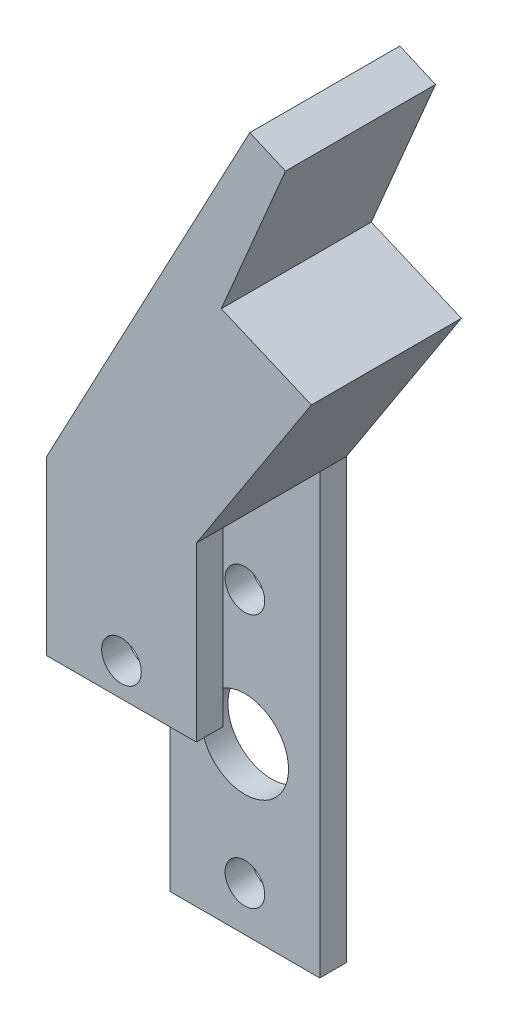
ISO-10303-21;
HEADER;
FILE_DESCRIPTION(('STEP AP214'),'2;1');
FILE_NAME('part.step','',(''),(''),'','','');
FILE_SCHEMA(('AUTOMOTIVE_DESIGN { 1 0 10303 214 1 1 1 1 }'));
ENDSEC;
DATA;
#1=APPLICATION_CONTEXT('core data for automotive mechanical design processes');
#2=APPLICATION_PROTOCOL_DEFINITION('international standard','automotive_design',2000,#1);
#3=PRODUCT_CONTEXT('',#1,'mechanical');
#4=PRODUCT('Part','Part','',(#3));
#5=PRODUCT_RELATED_PRODUCT_CATEGORY('part','',(#4));
#6=PRODUCT_DEFINITION_FORMATION('','',#4);
#7=PRODUCT_DEFINITION_CONTEXT('part definition',#1,'design');
#8=PRODUCT_DEFINITION('design','',#6,#7);
#9=PRODUCT_DEFINITION_SHAPE('','',#8);
#10=(LENGTH_UNIT() NAMED_UNIT(*) SI_UNIT(.MILLI.,.METRE.));
#11=(NAMED_UNIT(*) PLANE_ANGLE_UNIT() SI_UNIT($,.RADIAN.));
#12=(NAMED_UNIT(*) SI_UNIT($,.STERADIAN.) SOLID_ANGLE_UNIT());
#13=UNCERTAINTY_MEASURE_WITH_UNIT(LENGTH_MEASURE(1.E-05),#10,'distance_accuracy_value','');
#14=(GEOMETRIC_REPRESENTATION_CONTEXT(3) GLOBAL_UNCERTAINTY_ASSIGNED_CONTEXT((#13)) GLOBAL_UNIT_ASSIGNED_CONTEXT((#10,
#11,#12)) REPRESENTATION_CONTEXT('',''));
#15=CARTESIAN_POINT('',(0.,0.,0.));
#16=DIRECTION('',(0.,0.,1.));
#17=DIRECTION('',(1.,0.,0.));
#18=AXIS2_PLACEMENT_3D('',#15,#16,#17);
#19=CARTESIAN_POINT('',(-110.514643089675,1.26241017740988,14.3256));
#20=DIRECTION('',(1.,0.,0.));
#21=DIRECTION('',(0.,0.,-1.));
#22=AXIS2_PLACEMENT_3D('',#19,#20,#21);
#23=PLANE('',#22);
#24=DIRECTION('',(0.,0.,-1.));
#25=VECTOR('',#24,1.);
#26=CARTESIAN_POINT('',(-110.514643089675,26.6624101774099,14.3256));
#27=LINE('',#26,#25);
#28=CARTESIAN_POINT('',(-110.514643089675,26.6624101774099,14.3256));
#29=VERTEX_POINT('',#28);
#30=CARTESIAN_POINT('',(-110.514643089675,26.6624101774099,11.7856));
#31=VERTEX_POINT('',#30);
#32=EDGE_CURVE('E48',#29,#31,#27,.T.);
#33=ORIENTED_EDGE('',*,*,#32,.F.);
#34=DIRECTION('',(0.,-1.,0.));
#35=VECTOR('',#34,1.);
#36=CARTESIAN_POINT('',(-110.514643089675,1.26241017740988,14.3256));
#37=LINE('',#36,#35);
#38=CARTESIAN_POINT('',(-110.514643089675,43.1216101774099,14.3256));
#39=VERTEX_POINT('',#38);
#40=EDGE_CURVE('E134',#39,#29,#37,.T.);
#41=ORIENTED_EDGE('',*,*,#40,.F.);
#42=DIRECTION('',(0.,0.,-1.));
#43=VECTOR('',#42,1.);
#44=CARTESIAN_POINT('',(-110.514643089675,43.1216101774099,14.3256));
#45=LINE('',#44,#43);
#46=CARTESIAN_POINT('',(-110.514643089675,43.1216101774099,11.7856));
#47=VERTEX_POINT('',#46);
#48=EDGE_CURVE('E176',#39,#47,#45,.T.);
#49=ORIENTED_EDGE('',*,*,#48,.T.);
#50=DIRECTION('',(0.,1.,0.));
#51=VECTOR('',#50,1.);
#52=CARTESIAN_POINT('',(-110.514643089675,1.26241017740988,11.7856));
#53=LINE('',#52,#51);
#54=EDGE_CURVE('E54',#31,#47,#53,.T.);
#55=ORIENTED_EDGE('',*,*,#54,.F.);
#56=EDGE_LOOP('',(#33,#41,#49,#55));
#57=FACE_BOUND('',#56,.T.);
#58=ADVANCED_FACE('F33',(#57),#23,.F.);
#59=CARTESIAN_POINT('',(-96.2144430896747,1.26241017740988,14.3256));
#60=DIRECTION('',(-1.,0.,0.));
#61=DIRECTION('',(0.,-1.,0.));
#62=AXIS2_PLACEMENT_3D('',#59,#60,#61);
#63=PLANE('',#62);
#64=DIRECTION('',(0.,0.,-1.));
#65=VECTOR('',#64,1.);
#66=CARTESIAN_POINT('',(-96.2144430896746,26.6624101774099,0.));
#67=LINE('',#66,#65);
#68=CARTESIAN_POINT('',(-96.2144430896746,26.6624101774099,14.3256));
#69=VERTEX_POINT('',#68);
#70=CARTESIAN_POINT('',(-96.2144430896746,26.6624101774099,11.7856));
#71=VERTEX_POINT('',#70);
#72=EDGE_CURVE('E120',#69,#71,#67,.T.);
#73=ORIENTED_EDGE('',*,*,#72,.T.);
#74=DIRECTION('',(0.,1.,0.));
#75=VECTOR('',#74,1.);
#76=CARTESIAN_POINT('',(-96.2144430896747,0.,11.7856));
#77=LINE('',#76,#75);
#78=CARTESIAN_POINT('',(-96.2144430896746,43.1216101774099,11.7856));
#79=VERTEX_POINT('',#78);
#80=EDGE_CURVE('E273',#71,#79,#77,.T.);
#81=ORIENTED_EDGE('',*,*,#80,.T.);
#82=DIRECTION('',(0.,0.,-1.));
#83=VECTOR('',#82,1.);
#84=CARTESIAN_POINT('',(-96.2144430896746,43.1216101774099,14.3256));
#85=LINE('',#84,#83);
#86=CARTESIAN_POINT('',(-96.2144430896746,43.1216101774099,14.3256));
#87=VERTEX_POINT('',#86);
#88=EDGE_CURVE('E138',#87,#79,#85,.T.);
#89=ORIENTED_EDGE('',*,*,#88,.F.);
#90=DIRECTION('',(0.,1.,0.));
#91=VECTOR('',#90,1.);
#92=CARTESIAN_POINT('',(-96.2144430896747,1.26241017740988,14.3256));
#93=LINE('',#92,#91);
#94=EDGE_CURVE('E131',#69,#87,#93,.T.);
#95=ORIENTED_EDGE('',*,*,#94,.F.);
#96=EDGE_LOOP('',(#73,#81,#89,#95));
#97=FACE_BOUND('',#96,.T.);
#98=ADVANCED_FACE('F136',(#97),#63,.F.);
#99=CARTESIAN_POINT('',(0.,0.,14.3256));
#100=DIRECTION('',(0.,0.,-1.));
#101=DIRECTION('',(-1.,0.,0.));
#102=AXIS2_PLACEMENT_3D('',#99,#100,#101);
#103=PLANE('',#102);
#104=CARTESIAN_POINT('',(-103.364543089675,29.8120101774099,14.3256));
#105=DIRECTION('',(0.,0.,1.));
#106=DIRECTION('',(1.,0.,0.));
#107=AXIS2_PLACEMENT_3D('',#104,#105,#106);
#108=CIRCLE('',#107,1.89230000000001);
#109=CARTESIAN_POINT('',(-101.472243089675,29.8120101774099,14.3256));
#110=VERTEX_POINT('',#109);
#111=EDGE_CURVE('E217',#110,#110,#108,.T.);
#112=ORIENTED_EDGE('',*,*,#111,.F.);
#113=EDGE_LOOP('',(#112));
#114=FACE_BOUND('',#113,.T.);
#115=DIRECTION('',(1.,0.,0.));
#116=VECTOR('',#115,1.);
#117=CARTESIAN_POINT('',(-110.540043089675,26.6624101774099,14.3256));
#118=LINE('',#117,#116);
#119=EDGE_CURVE('E123',#29,#69,#118,.T.);
#120=ORIENTED_EDGE('',*,*,#119,.T.);
#121=ORIENTED_EDGE('',*,*,#94,.T.);
#122=DIRECTION('',(0.544639035015021,0.838670567945428,0.));
#123=VECTOR('',#122,1.);
#124=CARTESIAN_POINT('',(-96.2144430896746,43.1216101774099,14.3256));
#125=LINE('',#124,#123);
#126=CARTESIAN_POINT('',(-85.2303808871057,60.0355827235061,14.3256));
#127=VERTEX_POINT('',#126);
#128=EDGE_CURVE('E140',#87,#127,#125,.T.);
#129=ORIENTED_EDGE('',*,*,#128,.T.);
#130=DIRECTION('',(-0.920504853452446,0.390731128489259,0.));
#131=VECTOR('',#130,1.);
#132=CARTESIAN_POINT('',(-85.2303808871057,60.0355827235061,14.3256));
#133=LINE('',#132,#131);
#134=CARTESIAN_POINT('',(-93.8345238532964,63.6878247277209,14.3256));
#135=VERTEX_POINT('',#134);
#136=EDGE_CURVE('E142',#127,#135,#133,.T.);
#137=ORIENTED_EDGE('',*,*,#136,.T.);
#138=DIRECTION('',(0.39073112848926,0.920504853452446,0.));
#139=VECTOR('',#138,1.);
#140=CARTESIAN_POINT('',(-93.8345238532964,63.6878247277209,14.3256));
#141=LINE('',#140,#139);
#142=CARTESIAN_POINT('',(-87.7011391831749,78.1371735133344,14.3256));
#143=VERTEX_POINT('',#142);
#144=EDGE_CURVE('E149',#135,#143,#141,.T.);
#145=ORIENTED_EDGE('',*,*,#144,.T.);
#146=DIRECTION('',(-0.918111761638845,0.396321577939452,0.));
#147=VECTOR('',#146,1.);
#148=CARTESIAN_POINT('',(-91.1133551802976,79.6101258103794,14.3256));
#149=LINE('',#148,#147);
#150=CARTESIAN_POINT('',(-91.1133551802976,79.6101258103794,14.3256));
#151=VERTEX_POINT('',#150);
#152=EDGE_CURVE('E151',#143,#151,#149,.T.);
#153=ORIENTED_EDGE('',*,*,#152,.T.);
#154=DIRECTION('',(-0.469471562785889,-0.882947592858928,0.));
#155=VECTOR('',#154,1.);
#156=CARTESIAN_POINT('',(-110.514643089675,43.1216101774099,14.3256));
#157=LINE('',#156,#155);
#158=EDGE_CURVE('E153',#151,#39,#157,.T.);
#159=ORIENTED_EDGE('',*,*,#158,.T.);
#160=ORIENTED_EDGE('',*,*,#40,.T.);
#161=EDGE_LOOP('',(#120,#121,#129,#137,#145,#153,#159,#160));
#162=FACE_BOUND('',#161,.T.);
#163=ADVANCED_FACE('F130',(#114,#162),#103,.F.);
#164=CARTESIAN_POINT('',(-110.540043089675,0.,11.7856));
#165=DIRECTION('',(0.,0.,-1.));
#166=DIRECTION('',(-1.,0.,0.));
#167=AXIS2_PLACEMENT_3D('',#164,#165,#166);
#168=PLANE('',#167);
#169=CARTESIAN_POINT('',(-103.364543089675,29.8120101774099,11.7856));
#170=DIRECTION('',(0.,0.,-1.));
#171=DIRECTION('',(-1.,0.,0.));
#172=AXIS2_PLACEMENT_3D('',#169,#170,#171);
#173=CIRCLE('',#172,1.89230000000001);
#174=CARTESIAN_POINT('',(-105.256843089675,29.8120101774099,11.7856));
#175=VERTEX_POINT('',#174);
#176=EDGE_CURVE('E197',#175,#175,#173,.F.);
#177=ORIENTED_EDGE('',*,*,#176,.T.);
#178=EDGE_LOOP('',(#177));
#179=FACE_BOUND('',#178,.T.);
#180=ORIENTED_EDGE('',*,*,#80,.F.);
#181=DIRECTION('',(-1.,0.,0.));
#182=VECTOR('',#181,1.);
#183=CARTESIAN_POINT('',(-110.540043089675,26.6624101774099,11.7856));
#184=LINE('',#183,#182);
#185=EDGE_CURVE('E11',#71,#31,#184,.T.);
#186=ORIENTED_EDGE('',*,*,#185,.T.);
#187=ORIENTED_EDGE('',*,*,#54,.T.);
#188=DIRECTION('',(1.,0.,0.));
#189=VECTOR('',#188,1.);
#190=CARTESIAN_POINT('',(-110.540043089675,43.1216101774099,11.7856));
#191=LINE('',#190,#189);
#192=EDGE_CURVE('E258',#47,#79,#191,.T.);
#193=ORIENTED_EDGE('',*,*,#192,.T.);
#194=EDGE_LOOP('',(#180,#186,#187,#193));
#195=FACE_BOUND('',#194,.T.);
#196=ADVANCED_FACE('F290',(#179,#195),#168,.T.);
#197=DIRECTION('',(0.,-1.,0.));
#198=VECTOR('',#197,1.);
#199=CARTESIAN_POINT('',(-110.514643089675,1.26241017740989,2.54));
#200=LINE('',#199,#198);
#201=CARTESIAN_POINT('',(-110.514643089675,43.1216101774099,2.54));
#202=VERTEX_POINT('',#201);
#203=CARTESIAN_POINT('',(-110.514643089675,1.26241017740989,2.54));
#204=VERTEX_POINT('',#203);
#205=EDGE_CURVE('E215',#202,#204,#200,.T.);
#206=ORIENTED_EDGE('',*,*,#205,.F.);
#207=CARTESIAN_POINT('',(-110.514643089675,43.1216101774099,0.));
#208=VERTEX_POINT('',#207);
#209=EDGE_CURVE('E155',#202,#208,#45,.T.);
#210=ORIENTED_EDGE('',*,*,#209,.T.);
#211=DIRECTION('',(0.,-1.,0.));
#212=VECTOR('',#211,1.);
#213=CARTESIAN_POINT('',(-110.514643089675,1.26241017740988,0.));
#214=LINE('',#213,#212);
#215=CARTESIAN_POINT('',(-110.514643089675,1.26241017740988,0.));
#216=VERTEX_POINT('',#215);
#217=EDGE_CURVE('E156',#208,#216,#214,.T.);
#218=ORIENTED_EDGE('',*,*,#217,.T.);
#219=DIRECTION('',(0.,0.,-1.));
#220=VECTOR('',#219,1.);
#221=CARTESIAN_POINT('',(-110.514643089675,1.26241017740988,14.3256));
#222=LINE('',#221,#220);
#223=EDGE_CURVE('E41',#204,#216,#222,.T.);
#224=ORIENTED_EDGE('',*,*,#223,.F.);
#225=EDGE_LOOP('',(#206,#210,#218,#224));
#226=FACE_BOUND('',#225,.T.);
#227=ADVANCED_FACE('F35',(#226),#23,.F.);
#228=CARTESIAN_POINT('',(-110.514643089675,1.26241017740988,14.3256));
#229=DIRECTION('',(0.,1.,0.));
#230=DIRECTION('',(0.,0.,1.));
#231=AXIS2_PLACEMENT_3D('',#228,#229,#230);
#232=PLANE('',#231);
#233=DIRECTION('',(1.,0.,0.));
#234=VECTOR('',#233,1.);
#235=CARTESIAN_POINT('',(-110.540043089675,1.26241017740989,2.54));
#236=LINE('',#235,#234);
#237=CARTESIAN_POINT('',(-96.2144430896747,1.26241017740988,2.54));
#238=VERTEX_POINT('',#237);
#239=EDGE_CURVE('E199',#204,#238,#236,.T.);
#240=ORIENTED_EDGE('',*,*,#239,.F.);
#241=ORIENTED_EDGE('',*,*,#223,.T.);
#242=DIRECTION('',(1.,0.,0.));
#243=VECTOR('',#242,1.);
#244=CARTESIAN_POINT('',(-110.514643089675,1.26241017740988,0.));
#245=LINE('',#244,#243);
#246=CARTESIAN_POINT('',(-96.2144430896747,1.26241017740988,0.));
#247=VERTEX_POINT('',#246);
#248=EDGE_CURVE('E159',#216,#247,#245,.T.);
#249=ORIENTED_EDGE('',*,*,#248,.T.);
#250=DIRECTION('',(0.,0.,-1.));
#251=VECTOR('',#250,1.);
#252=CARTESIAN_POINT('',(-96.2144430896747,1.26241017740988,14.3256));
#253=LINE('',#252,#251);
#254=EDGE_CURVE('E194',#238,#247,#253,.T.);
#255=ORIENTED_EDGE('',*,*,#254,.F.);
#256=EDGE_LOOP('',(#240,#241,#249,#255));
#257=FACE_BOUND('',#256,.T.);
#258=ADVANCED_FACE('F256',(#257),#232,.F.);
#259=DIRECTION('',(0.,-1.,0.));
#260=VECTOR('',#259,1.);
#261=CARTESIAN_POINT('',(-96.2144430896747,0.,2.54));
#262=LINE('',#261,#260);
#263=CARTESIAN_POINT('',(-96.2144430896746,43.1216101774099,2.54));
#264=VERTEX_POINT('',#263);
#265=EDGE_CURVE('E269',#264,#238,#262,.T.);
#266=ORIENTED_EDGE('',*,*,#265,.T.);
#267=ORIENTED_EDGE('',*,*,#254,.T.);
#268=DIRECTION('',(0.,1.,0.));
#269=VECTOR('',#268,1.);
#270=CARTESIAN_POINT('',(-96.2144430896747,1.26241017740988,0.));
#271=LINE('',#270,#269);
#272=CARTESIAN_POINT('',(-96.2144430896746,43.1216101774099,0.));
#273=VERTEX_POINT('',#272);
#274=EDGE_CURVE('E163',#247,#273,#271,.T.);
#275=ORIENTED_EDGE('',*,*,#274,.T.);
#276=EDGE_CURVE('E192',#264,#273,#85,.T.);
#277=ORIENTED_EDGE('',*,*,#276,.F.);
#278=EDGE_LOOP('',(#266,#267,#275,#277));
#279=FACE_BOUND('',#278,.T.);
#280=ADVANCED_FACE('F235',(#279),#63,.F.);
#281=CARTESIAN_POINT('',(-103.364543089675,5.52961017740988,0.));
#282=DIRECTION('',(0.,0.,1.));
#283=DIRECTION('',(1.,0.,0.));
#284=AXIS2_PLACEMENT_3D('',#281,#282,#283);
#285=CYLINDRICAL_SURFACE('',#284,1.89230000000001);
#286=CARTESIAN_POINT('',(-103.364543089675,5.52961017740988,0.));
#287=DIRECTION('',(0.,0.,1.));
#288=DIRECTION('',(1.,0.,0.));
#289=AXIS2_PLACEMENT_3D('',#286,#287,#288);
#290=CIRCLE('',#289,1.89230000000001);
#291=CARTESIAN_POINT('',(-101.472243089675,5.52961017740988,0.));
#292=VERTEX_POINT('',#291);
#293=EDGE_CURVE('E160',#292,#292,#290,.T.);
#294=ORIENTED_EDGE('',*,*,#293,.F.);
#295=EDGE_LOOP('',(#294));
#296=FACE_BOUND('',#295,.T.);
#297=CARTESIAN_POINT('',(-103.364543089675,5.52961017740988,2.54));
#298=DIRECTION('',(0.,0.,1.));
#299=DIRECTION('',(0.,-1.,0.));
#300=AXIS2_PLACEMENT_3D('',#297,#298,#299);
#301=CIRCLE('',#300,1.89230000000001);
#302=CARTESIAN_POINT('',(-103.364543089675,3.63731017740988,2.54));
#303=VERTEX_POINT('',#302);
#304=EDGE_CURVE('E206',#303,#303,#301,.F.);
#305=ORIENTED_EDGE('',*,*,#304,.F.);
#306=EDGE_LOOP('',(#305));
#307=FACE_BOUND('',#306,.T.);
#308=ADVANCED_FACE('F231',(#296,#307),#285,.F.);
#309=CARTESIAN_POINT('',(-103.364543089675,17.0358101774099,0.));
#310=DIRECTION('',(0.,0.,1.));
#311=DIRECTION('',(1.,0.,0.));
#312=AXIS2_PLACEMENT_3D('',#309,#310,#311);
#313=CYLINDRICAL_SURFACE('',#312,4.1656);
#314=CARTESIAN_POINT('',(-103.364543089675,17.0358101774099,0.));
#315=DIRECTION('',(0.,0.,1.));
#316=DIRECTION('',(1.,0.,0.));
#317=AXIS2_PLACEMENT_3D('',#314,#315,#316);
#318=CIRCLE('',#317,4.1656);
#319=CARTESIAN_POINT('',(-99.1989430896747,17.0358101774099,0.));
#320=VERTEX_POINT('',#319);
#321=EDGE_CURVE('E221',#320,#320,#318,.T.);
#322=ORIENTED_EDGE('',*,*,#321,.F.);
#323=EDGE_LOOP('',(#322));
#324=FACE_BOUND('',#323,.T.);
#325=CARTESIAN_POINT('',(-103.364543089675,17.0358101774099,2.54));
#326=DIRECTION('',(0.,0.,1.));
#327=DIRECTION('',(0.,-1.,0.));
#328=AXIS2_PLACEMENT_3D('',#325,#326,#327);
#329=CIRCLE('',#328,4.1656);
#330=CARTESIAN_POINT('',(-103.364543089675,12.8702101774099,2.54));
#331=VERTEX_POINT('',#330);
#332=EDGE_CURVE('E202',#331,#331,#329,.F.);
#333=ORIENTED_EDGE('',*,*,#332,.F.);
#334=EDGE_LOOP('',(#333));
#335=FACE_BOUND('',#334,.T.);
#336=ADVANCED_FACE('F234',(#324,#335),#313,.F.);
#337=CARTESIAN_POINT('',(-103.364543089675,29.8120101774099,0.));
#338=DIRECTION('',(0.,0.,1.));
#339=DIRECTION('',(1.,0.,0.));
#340=AXIS2_PLACEMENT_3D('',#337,#338,#339);
#341=CYLINDRICAL_SURFACE('',#340,1.89230000000001);
#342=CARTESIAN_POINT('',(-103.364543089675,29.8120101774099,0.));
#343=DIRECTION('',(0.,0.,1.));
#344=DIRECTION('',(1.,0.,0.));
#345=AXIS2_PLACEMENT_3D('',#342,#343,#344);
#346=CIRCLE('',#345,1.89230000000001);
#347=CARTESIAN_POINT('',(-101.472243089675,29.8120101774099,0.));
#348=VERTEX_POINT('',#347);
#349=EDGE_CURVE('E218',#348,#348,#346,.T.);
#350=ORIENTED_EDGE('',*,*,#349,.F.);
#351=EDGE_LOOP('',(#350));
#352=FACE_BOUND('',#351,.T.);
#353=CARTESIAN_POINT('',(-103.364543089675,29.8120101774099,2.54));
#354=DIRECTION('',(0.,0.,1.));
#355=DIRECTION('',(0.,-1.,0.));
#356=AXIS2_PLACEMENT_3D('',#353,#354,#355);
#357=CIRCLE('',#356,1.89230000000001);
#358=CARTESIAN_POINT('',(-103.364543089675,27.9197101774099,2.54));
#359=VERTEX_POINT('',#358);
#360=EDGE_CURVE('E200',#359,#359,#357,.F.);
#361=ORIENTED_EDGE('',*,*,#360,.F.);
#362=EDGE_LOOP('',(#361));
#363=FACE_BOUND('',#362,.T.);
#364=ADVANCED_FACE('F306',(#352,#363),#341,.F.);
#365=ORIENTED_EDGE('',*,*,#111,.T.);
#366=EDGE_LOOP('',(#365));
#367=FACE_BOUND('',#366,.T.);
#368=ORIENTED_EDGE('',*,*,#176,.F.);
#369=EDGE_LOOP('',(#368));
#370=FACE_BOUND('',#369,.T.);
#371=ADVANCED_FACE('F309',(#367,#370),#341,.F.);
#372=CARTESIAN_POINT('',(-96.2144430896746,43.1216101774099,14.3256));
#373=DIRECTION('',(-0.838670567945428,0.544639035015021,0.));
#374=DIRECTION('',(-0.544639035015021,-0.838670567945428,0.));
#375=AXIS2_PLACEMENT_3D('',#372,#373,#374);
#376=PLANE('',#375);
#377=DIRECTION('',(0.544639035015021,0.838670567945428,0.));
#378=VECTOR('',#377,1.);
#379=CARTESIAN_POINT('',(-96.2144430896746,43.1216101774099,0.));
#380=LINE('',#379,#378);
#381=CARTESIAN_POINT('',(-85.2303808871057,60.0355827235061,0.));
#382=VERTEX_POINT('',#381);
#383=EDGE_CURVE('E166',#273,#382,#380,.T.);
#384=ORIENTED_EDGE('',*,*,#383,.T.);
#385=DIRECTION('',(0.,0.,-1.));
#386=VECTOR('',#385,1.);
#387=CARTESIAN_POINT('',(-85.2303808871057,60.0355827235061,14.3256));
#388=LINE('',#387,#386);
#389=EDGE_CURVE('E189',#127,#382,#388,.T.);
#390=ORIENTED_EDGE('',*,*,#389,.F.);
#391=ORIENTED_EDGE('',*,*,#128,.F.);
#392=ORIENTED_EDGE('',*,*,#88,.T.);
#393=DIRECTION('',(0.,0.,1.));
#394=VECTOR('',#393,1.);
#395=CARTESIAN_POINT('',(-96.2144430896746,43.1216101774099,0.));
#396=LINE('',#395,#394);
#397=EDGE_CURVE('E270',#264,#79,#396,.T.);
#398=ORIENTED_EDGE('',*,*,#397,.F.);
#399=ORIENTED_EDGE('',*,*,#276,.T.);
#400=EDGE_LOOP('',(#384,#390,#391,#392,#398,#399));
#401=FACE_BOUND('',#400,.T.);
#402=ADVANCED_FACE('F330',(#401),#376,.F.);
#403=CARTESIAN_POINT('',(-85.2303808871057,60.0355827235061,14.3256));
#404=DIRECTION('',(-0.390731128489259,-0.920504853452447,0.));
#405=DIRECTION('',(0.920504853452447,-0.390731128489259,0.));
#406=AXIS2_PLACEMENT_3D('',#403,#404,#405);
#407=PLANE('',#406);
#408=DIRECTION('',(-0.920504853452446,0.390731128489259,0.));
#409=VECTOR('',#408,1.);
#410=CARTESIAN_POINT('',(-85.2303808871057,60.0355827235061,0.));
#411=LINE('',#410,#409);
#412=CARTESIAN_POINT('',(-93.8345238532964,63.6878247277209,0.));
#413=VERTEX_POINT('',#412);
#414=EDGE_CURVE('E168',#382,#413,#411,.T.);
#415=ORIENTED_EDGE('',*,*,#414,.T.);
#416=DIRECTION('',(0.,0.,-1.));
#417=VECTOR('',#416,1.);
#418=CARTESIAN_POINT('',(-93.8345238532964,63.6878247277209,14.3256));
#419=LINE('',#418,#417);
#420=EDGE_CURVE('E186',#135,#413,#419,.T.);
#421=ORIENTED_EDGE('',*,*,#420,.F.);
#422=ORIENTED_EDGE('',*,*,#136,.F.);
#423=ORIENTED_EDGE('',*,*,#389,.T.);
#424=EDGE_LOOP('',(#415,#421,#422,#423));
#425=FACE_BOUND('',#424,.T.);
#426=ADVANCED_FACE('F326',(#425),#407,.F.);
#427=CARTESIAN_POINT('',(-93.8345238532964,63.6878247277209,14.3256));
#428=DIRECTION('',(-0.920504853452446,0.390731128489261,0.));
#429=DIRECTION('',(-0.390731128489261,-0.920504853452446,0.));
#430=AXIS2_PLACEMENT_3D('',#427,#428,#429);
#431=PLANE('',#430);
#432=DIRECTION('',(0.39073112848926,0.920504853452446,0.));
#433=VECTOR('',#432,1.);
#434=CARTESIAN_POINT('',(-93.8345238532964,63.6878247277209,0.));
#435=LINE('',#434,#433);
#436=CARTESIAN_POINT('',(-87.7011391831749,78.1371735133344,0.));
#437=VERTEX_POINT('',#436);
#438=EDGE_CURVE('E170',#413,#437,#435,.T.);
#439=ORIENTED_EDGE('',*,*,#438,.T.);
#440=DIRECTION('',(0.,0.,-1.));
#441=VECTOR('',#440,1.);
#442=CARTESIAN_POINT('',(-87.7011391831749,78.1371735133344,14.3256));
#443=LINE('',#442,#441);
#444=EDGE_CURVE('E183',#143,#437,#443,.T.);
#445=ORIENTED_EDGE('',*,*,#444,.F.);
#446=ORIENTED_EDGE('',*,*,#144,.F.);
#447=ORIENTED_EDGE('',*,*,#420,.T.);
#448=EDGE_LOOP('',(#439,#445,#446,#447));
#449=FACE_BOUND('',#448,.T.);
#450=ADVANCED_FACE('F322',(#449),#431,.F.);
#451=CARTESIAN_POINT('',(-91.1133551802976,79.6101258103794,14.3256));
#452=DIRECTION('',(-0.396321577939452,-0.918111761638845,0.));
#453=DIRECTION('',(0.918111761638845,-0.396321577939452,0.));
#454=AXIS2_PLACEMENT_3D('',#451,#452,#453);
#455=PLANE('',#454);
#456=DIRECTION('',(-0.918111761638845,0.396321577939452,0.));
#457=VECTOR('',#456,1.);
#458=CARTESIAN_POINT('',(-91.1133551802976,79.6101258103794,0.));
#459=LINE('',#458,#457);
#460=CARTESIAN_POINT('',(-91.1133551802976,79.6101258103794,0.));
#461=VERTEX_POINT('',#460);
#462=EDGE_CURVE('E172',#437,#461,#459,.T.);
#463=ORIENTED_EDGE('',*,*,#462,.T.);
#464=DIRECTION('',(0.,0.,-1.));
#465=VECTOR('',#464,1.);
#466=CARTESIAN_POINT('',(-91.1133551802976,79.6101258103794,14.3256));
#467=LINE('',#466,#465);
#468=EDGE_CURVE('E179',#151,#461,#467,.T.);
#469=ORIENTED_EDGE('',*,*,#468,.F.);
#470=ORIENTED_EDGE('',*,*,#152,.F.);
#471=ORIENTED_EDGE('',*,*,#444,.T.);
#472=EDGE_LOOP('',(#463,#469,#470,#471));
#473=FACE_BOUND('',#472,.T.);
#474=ADVANCED_FACE('F319',(#473),#455,.F.);
#475=CARTESIAN_POINT('',(-110.514643089675,43.1216101774099,14.3256));
#476=DIRECTION('',(0.882947592858928,-0.469471562785889,0.));
#477=DIRECTION('',(0.469471562785889,0.882947592858928,0.));
#478=AXIS2_PLACEMENT_3D('',#475,#476,#477);
#479=PLANE('',#478);
#480=DIRECTION('',(-0.469471562785889,-0.882947592858928,0.));
#481=VECTOR('',#480,1.);
#482=CARTESIAN_POINT('',(-110.514643089675,43.1216101774099,0.));
#483=LINE('',#482,#481);
#484=EDGE_CURVE('E144',#461,#208,#483,.T.);
#485=ORIENTED_EDGE('',*,*,#484,.T.);
#486=ORIENTED_EDGE('',*,*,#209,.F.);
#487=EDGE_CURVE('E180',#47,#202,#45,.T.);
#488=ORIENTED_EDGE('',*,*,#487,.F.);
#489=ORIENTED_EDGE('',*,*,#48,.F.);
#490=ORIENTED_EDGE('',*,*,#158,.F.);
#491=ORIENTED_EDGE('',*,*,#468,.T.);
#492=EDGE_LOOP('',(#485,#486,#488,#489,#490,#491));
#493=FACE_BOUND('',#492,.T.);
#494=ADVANCED_FACE('F281',(#493),#479,.F.);
#495=CARTESIAN_POINT('',(0.,0.,0.));
#496=DIRECTION('',(0.,0.,-1.));
#497=DIRECTION('',(-1.,0.,0.));
#498=AXIS2_PLACEMENT_3D('',#495,#496,#497);
#499=PLANE('',#498);
#500=ORIENTED_EDGE('',*,*,#349,.T.);
#501=EDGE_LOOP('',(#500));
#502=FACE_BOUND('',#501,.T.);
#503=ORIENTED_EDGE('',*,*,#321,.T.);
#504=EDGE_LOOP('',(#503));
#505=FACE_BOUND('',#504,.T.);
#506=ORIENTED_EDGE('',*,*,#293,.T.);
#507=EDGE_LOOP('',(#506));
#508=FACE_BOUND('',#507,.T.);
#509=ORIENTED_EDGE('',*,*,#217,.F.);
#510=ORIENTED_EDGE('',*,*,#484,.F.);
#511=ORIENTED_EDGE('',*,*,#462,.F.);
#512=ORIENTED_EDGE('',*,*,#438,.F.);
#513=ORIENTED_EDGE('',*,*,#414,.F.);
#514=ORIENTED_EDGE('',*,*,#383,.F.);
#515=ORIENTED_EDGE('',*,*,#274,.F.);
#516=ORIENTED_EDGE('',*,*,#248,.F.);
#517=EDGE_LOOP('',(#509,#510,#511,#512,#513,#514,#515,#516));
#518=FACE_BOUND('',#517,.T.);
#519=ADVANCED_FACE('F228',(#502,#505,#508,#518),#499,.T.);
#520=CARTESIAN_POINT('',(-110.540043089675,43.1216101774099,0.));
#521=DIRECTION('',(0.,1.,0.));
#522=DIRECTION('',(-1.,0.,0.));
#523=AXIS2_PLACEMENT_3D('',#520,#521,#522);
#524=PLANE('',#523);
#525=DIRECTION('',(1.,0.,0.));
#526=VECTOR('',#525,1.);
#527=CARTESIAN_POINT('',(-110.540043089675,43.1216101774099,2.54));
#528=LINE('',#527,#526);
#529=EDGE_CURVE('E210',#202,#264,#528,.T.);
#530=ORIENTED_EDGE('',*,*,#529,.T.);
#531=ORIENTED_EDGE('',*,*,#397,.T.);
#532=ORIENTED_EDGE('',*,*,#192,.F.);
#533=ORIENTED_EDGE('',*,*,#487,.T.);
#534=EDGE_LOOP('',(#530,#531,#532,#533));
#535=FACE_BOUND('',#534,.T.);
#536=ADVANCED_FACE('F241',(#535),#524,.F.);
#537=CARTESIAN_POINT('',(-110.540043089675,0.,2.54));
#538=DIRECTION('',(0.,0.,1.));
#539=DIRECTION('',(0.,-1.,0.));
#540=AXIS2_PLACEMENT_3D('',#537,#538,#539);
#541=PLANE('',#540);
#542=ORIENTED_EDGE('',*,*,#304,.T.);
#543=EDGE_LOOP('',(#542));
#544=FACE_BOUND('',#543,.T.);
#545=ORIENTED_EDGE('',*,*,#360,.T.);
#546=EDGE_LOOP('',(#545));
#547=FACE_BOUND('',#546,.T.);
#548=ORIENTED_EDGE('',*,*,#332,.T.);
#549=EDGE_LOOP('',(#548));
#550=FACE_BOUND('',#549,.T.);
#551=ORIENTED_EDGE('',*,*,#205,.T.);
#552=ORIENTED_EDGE('',*,*,#239,.T.);
#553=ORIENTED_EDGE('',*,*,#265,.F.);
#554=ORIENTED_EDGE('',*,*,#529,.F.);
#555=EDGE_LOOP('',(#551,#552,#553,#554));
#556=FACE_BOUND('',#555,.T.);
#557=ADVANCED_FACE('F239',(#544,#547,#550,#556),#541,.T.);
#558=CARTESIAN_POINT('',(-110.540043089675,26.6624101774099,0.));
#559=DIRECTION('',(0.,-1.,0.));
#560=DIRECTION('',(1.,0.,0.));
#561=AXIS2_PLACEMENT_3D('',#558,#559,#560);
#562=PLANE('',#561);
#563=ORIENTED_EDGE('',*,*,#32,.T.);
#564=ORIENTED_EDGE('',*,*,#185,.F.);
#565=ORIENTED_EDGE('',*,*,#72,.F.);
#566=ORIENTED_EDGE('',*,*,#119,.F.);
#567=EDGE_LOOP('',(#563,#564,#565,#566));
#568=FACE_BOUND('',#567,.T.);
#569=ADVANCED_FACE('F122',(#568),#562,.T.);
#570=CLOSED_SHELL('',(#58,#98,#163,#196,#227,#258,#280,#308,#336,#364,#371,#402,#426,#450,#474,
#494,#519,#536,#557,#569));
#571=MANIFOLD_SOLID_BREP('B2',#570);
#572=ADVANCED_BREP_SHAPE_REPRESENTATION('',(#18,#571),#14);
#573=SHAPE_DEFINITION_REPRESENTATION(#9,#572);
ENDSEC;
END-ISO-10303-21;
